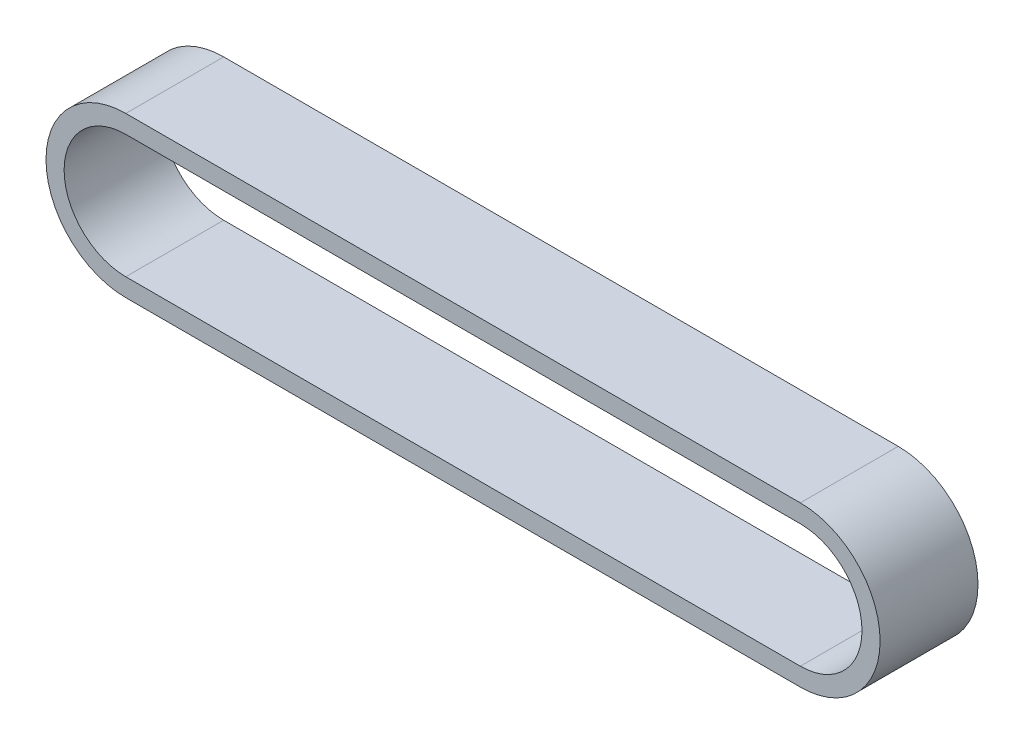
ISO-10303-21;
HEADER;
FILE_DESCRIPTION(('STEP AP214'),'2;1');
FILE_NAME('part.step','',(''),(''),'','','');
FILE_SCHEMA(('AUTOMOTIVE_DESIGN { 1 0 10303 214 1 1 1 1 }'));
ENDSEC;
DATA;
#1=APPLICATION_CONTEXT('core data for automotive mechanical design processes');
#2=APPLICATION_PROTOCOL_DEFINITION('international standard','automotive_design',2000,#1);
#3=PRODUCT_CONTEXT('',#1,'mechanical');
#4=PRODUCT('Part','Part','',(#3));
#5=PRODUCT_RELATED_PRODUCT_CATEGORY('part','',(#4));
#6=PRODUCT_DEFINITION_FORMATION('','',#4);
#7=PRODUCT_DEFINITION_CONTEXT('part definition',#1,'design');
#8=PRODUCT_DEFINITION('design','',#6,#7);
#9=PRODUCT_DEFINITION_SHAPE('','',#8);
#10=(LENGTH_UNIT() NAMED_UNIT(*) SI_UNIT(.MILLI.,.METRE.));
#11=(NAMED_UNIT(*) PLANE_ANGLE_UNIT() SI_UNIT($,.RADIAN.));
#12=(NAMED_UNIT(*) SI_UNIT($,.STERADIAN.) SOLID_ANGLE_UNIT());
#13=UNCERTAINTY_MEASURE_WITH_UNIT(LENGTH_MEASURE(1.E-05),#10,'distance_accuracy_value','');
#14=(GEOMETRIC_REPRESENTATION_CONTEXT(3) GLOBAL_UNCERTAINTY_ASSIGNED_CONTEXT((#13)) GLOBAL_UNIT_ASSIGNED_CONTEXT((#10,
#11,#12)) REPRESENTATION_CONTEXT('',''));
#15=CARTESIAN_POINT('',(0.,0.,0.));
#16=DIRECTION('',(0.,0.,1.));
#17=DIRECTION('',(1.,0.,0.));
#18=AXIS2_PLACEMENT_3D('',#15,#16,#17);
#19=CARTESIAN_POINT('',(87.5,0.,25.4));
#20=DIRECTION('',(0.,0.,1.));
#21=DIRECTION('',(1.,0.,0.));
#22=AXIS2_PLACEMENT_3D('',#19,#20,#21);
#23=PLANE('',#22);
#24=CARTESIAN_POINT('',(87.5,0.,25.4));
#25=DIRECTION('',(0.,0.,1.));
#26=DIRECTION('',(1.,0.,0.));
#27=AXIS2_PLACEMENT_3D('',#24,#25,#26);
#28=CIRCLE('',#27,20.7);
#29=CARTESIAN_POINT('',(87.5,-20.7,25.4));
#30=VERTEX_POINT('',#29);
#31=CARTESIAN_POINT('',(87.5,20.7,25.4));
#32=VERTEX_POINT('',#31);
#33=EDGE_CURVE('E153',#30,#32,#28,.T.);
#34=ORIENTED_EDGE('',*,*,#33,.T.);
#35=DIRECTION('',(-1.,0.,0.));
#36=VECTOR('',#35,1.);
#37=CARTESIAN_POINT('',(87.5,20.7,25.4));
#38=LINE('',#37,#36);
#39=CARTESIAN_POINT('',(-87.5,20.7,25.4));
#40=VERTEX_POINT('',#39);
#41=EDGE_CURVE('E157',#32,#40,#38,.T.);
#42=ORIENTED_EDGE('',*,*,#41,.T.);
#43=CARTESIAN_POINT('',(-87.5,0.,25.4));
#44=DIRECTION('',(0.,0.,1.));
#45=DIRECTION('',(1.,0.,0.));
#46=AXIS2_PLACEMENT_3D('',#43,#44,#45);
#47=CIRCLE('',#46,20.7);
#48=CARTESIAN_POINT('',(-87.5,-20.7,25.4));
#49=VERTEX_POINT('',#48);
#50=EDGE_CURVE('E161',#40,#49,#47,.T.);
#51=ORIENTED_EDGE('',*,*,#50,.T.);
#52=DIRECTION('',(1.,0.,0.));
#53=VECTOR('',#52,1.);
#54=CARTESIAN_POINT('',(87.5,-20.7,25.4));
#55=LINE('',#54,#53);
#56=EDGE_CURVE('E164',#49,#30,#55,.T.);
#57=ORIENTED_EDGE('',*,*,#56,.T.);
#58=EDGE_LOOP('',(#34,#42,#51,#57));
#59=FACE_BOUND('',#58,.T.);
#60=DIRECTION('',(-1.,0.,0.));
#61=VECTOR('',#60,1.);
#62=CARTESIAN_POINT('',(87.5,16.,25.4));
#63=LINE('',#62,#61);
#64=CARTESIAN_POINT('',(87.5,16.,25.4));
#65=VERTEX_POINT('',#64);
#66=CARTESIAN_POINT('',(-87.5,16.,25.4));
#67=VERTEX_POINT('',#66);
#68=EDGE_CURVE('E114',#65,#67,#63,.T.);
#69=ORIENTED_EDGE('',*,*,#68,.F.);
#70=CARTESIAN_POINT('',(87.5,0.,25.4));
#71=DIRECTION('',(0.,0.,1.));
#72=DIRECTION('',(1.,0.,0.));
#73=AXIS2_PLACEMENT_3D('',#70,#71,#72);
#74=CIRCLE('',#73,16.);
#75=CARTESIAN_POINT('',(87.5,-16.,25.4));
#76=VERTEX_POINT('',#75);
#77=EDGE_CURVE('E105',#76,#65,#74,.T.);
#78=ORIENTED_EDGE('',*,*,#77,.F.);
#79=DIRECTION('',(1.,0.,0.));
#80=VECTOR('',#79,1.);
#81=CARTESIAN_POINT('',(87.5,-16.,25.4));
#82=LINE('',#81,#80);
#83=CARTESIAN_POINT('',(-87.5,-16.,25.4));
#84=VERTEX_POINT('',#83);
#85=EDGE_CURVE('E131',#84,#76,#82,.T.);
#86=ORIENTED_EDGE('',*,*,#85,.F.);
#87=CARTESIAN_POINT('',(-87.5,0.,25.4));
#88=DIRECTION('',(0.,0.,1.));
#89=DIRECTION('',(1.,0.,0.));
#90=AXIS2_PLACEMENT_3D('',#87,#88,#89);
#91=CIRCLE('',#90,16.);
#92=EDGE_CURVE('E127',#67,#84,#91,.T.);
#93=ORIENTED_EDGE('',*,*,#92,.F.);
#94=EDGE_LOOP('',(#69,#78,#86,#93));
#95=FACE_BOUND('',#94,.T.);
#96=ADVANCED_FACE('F39',(#59,#95),#23,.T.);
#97=CARTESIAN_POINT('',(87.5,0.,0.));
#98=DIRECTION('',(0.,0.,1.));
#99=DIRECTION('',(1.,0.,0.));
#100=AXIS2_PLACEMENT_3D('',#97,#98,#99);
#101=PLANE('',#100);
#102=CARTESIAN_POINT('',(87.5,0.,0.));
#103=DIRECTION('',(0.,0.,1.));
#104=DIRECTION('',(1.,0.,0.));
#105=AXIS2_PLACEMENT_3D('',#102,#103,#104);
#106=CIRCLE('',#105,20.7);
#107=CARTESIAN_POINT('',(87.5,-20.7,0.));
#108=VERTEX_POINT('',#107);
#109=CARTESIAN_POINT('',(87.5,20.7,0.));
#110=VERTEX_POINT('',#109);
#111=EDGE_CURVE('E123',#108,#110,#106,.T.);
#112=ORIENTED_EDGE('',*,*,#111,.F.);
#113=DIRECTION('',(1.,0.,0.));
#114=VECTOR('',#113,1.);
#115=CARTESIAN_POINT('',(87.5,-20.7,0.));
#116=LINE('',#115,#114);
#117=CARTESIAN_POINT('',(-87.5,-20.7,0.));
#118=VERTEX_POINT('',#117);
#119=EDGE_CURVE('E158',#118,#108,#116,.T.);
#120=ORIENTED_EDGE('',*,*,#119,.F.);
#121=CARTESIAN_POINT('',(-87.5,0.,0.));
#122=DIRECTION('',(0.,0.,1.));
#123=DIRECTION('',(1.,0.,0.));
#124=AXIS2_PLACEMENT_3D('',#121,#122,#123);
#125=CIRCLE('',#124,20.7);
#126=CARTESIAN_POINT('',(-87.5,20.7,0.));
#127=VERTEX_POINT('',#126);
#128=EDGE_CURVE('E174',#127,#118,#125,.T.);
#129=ORIENTED_EDGE('',*,*,#128,.F.);
#130=DIRECTION('',(-1.,0.,0.));
#131=VECTOR('',#130,1.);
#132=CARTESIAN_POINT('',(87.5,20.7,0.));
#133=LINE('',#132,#131);
#134=EDGE_CURVE('E171',#110,#127,#133,.T.);
#135=ORIENTED_EDGE('',*,*,#134,.F.);
#136=EDGE_LOOP('',(#112,#120,#129,#135));
#137=FACE_BOUND('',#136,.T.);
#138=CARTESIAN_POINT('',(87.5,0.,0.));
#139=DIRECTION('',(0.,0.,1.));
#140=DIRECTION('',(1.,0.,0.));
#141=AXIS2_PLACEMENT_3D('',#138,#139,#140);
#142=CIRCLE('',#141,16.);
#143=CARTESIAN_POINT('',(87.5,-16.,0.));
#144=VERTEX_POINT('',#143);
#145=CARTESIAN_POINT('',(87.5,16.,0.));
#146=VERTEX_POINT('',#145);
#147=EDGE_CURVE('E63',#144,#146,#142,.T.);
#148=ORIENTED_EDGE('',*,*,#147,.T.);
#149=DIRECTION('',(-1.,0.,0.));
#150=VECTOR('',#149,1.);
#151=CARTESIAN_POINT('',(87.5,16.,0.));
#152=LINE('',#151,#150);
#153=CARTESIAN_POINT('',(-87.5,16.,0.));
#154=VERTEX_POINT('',#153);
#155=EDGE_CURVE('E121',#146,#154,#152,.T.);
#156=ORIENTED_EDGE('',*,*,#155,.T.);
#157=CARTESIAN_POINT('',(-87.5,0.,0.));
#158=DIRECTION('',(0.,0.,1.));
#159=DIRECTION('',(1.,0.,0.));
#160=AXIS2_PLACEMENT_3D('',#157,#158,#159);
#161=CIRCLE('',#160,16.);
#162=CARTESIAN_POINT('',(-87.5,-16.,0.));
#163=VERTEX_POINT('',#162);
#164=EDGE_CURVE('E140',#154,#163,#161,.T.);
#165=ORIENTED_EDGE('',*,*,#164,.T.);
#166=DIRECTION('',(1.,0.,0.));
#167=VECTOR('',#166,1.);
#168=CARTESIAN_POINT('',(87.5,-16.,0.));
#169=LINE('',#168,#167);
#170=EDGE_CURVE('E115',#163,#144,#169,.T.);
#171=ORIENTED_EDGE('',*,*,#170,.T.);
#172=EDGE_LOOP('',(#148,#156,#165,#171));
#173=FACE_BOUND('',#172,.T.);
#174=ADVANCED_FACE('F197',(#137,#173),#101,.F.);
#175=CARTESIAN_POINT('',(87.5,0.,25.4));
#176=DIRECTION('',(0.,0.,-1.));
#177=DIRECTION('',(-1.,0.,0.));
#178=AXIS2_PLACEMENT_3D('',#175,#176,#177);
#179=CYLINDRICAL_SURFACE('',#178,20.7);
#180=ORIENTED_EDGE('',*,*,#111,.T.);
#181=DIRECTION('',(0.,0.,-1.));
#182=VECTOR('',#181,1.);
#183=CARTESIAN_POINT('',(87.5,20.7,25.4));
#184=LINE('',#183,#182);
#185=EDGE_CURVE('E11',#32,#110,#184,.T.);
#186=ORIENTED_EDGE('',*,*,#185,.F.);
#187=ORIENTED_EDGE('',*,*,#33,.F.);
#188=DIRECTION('',(0.,0.,-1.));
#189=VECTOR('',#188,1.);
#190=CARTESIAN_POINT('',(87.5,-20.7,25.4));
#191=LINE('',#190,#189);
#192=EDGE_CURVE('E167',#30,#108,#191,.T.);
#193=ORIENTED_EDGE('',*,*,#192,.T.);
#194=EDGE_LOOP('',(#180,#186,#187,#193));
#195=FACE_BOUND('',#194,.T.);
#196=ADVANCED_FACE('F41',(#195),#179,.T.);
#197=CARTESIAN_POINT('',(87.5,20.7,25.4));
#198=DIRECTION('',(0.,-1.,0.));
#199=DIRECTION('',(1.,0.,0.));
#200=AXIS2_PLACEMENT_3D('',#197,#198,#199);
#201=PLANE('',#200);
#202=ORIENTED_EDGE('',*,*,#134,.T.);
#203=DIRECTION('',(0.,0.,-1.));
#204=VECTOR('',#203,1.);
#205=CARTESIAN_POINT('',(-87.5,20.7,25.4));
#206=LINE('',#205,#204);
#207=EDGE_CURVE('E48',#40,#127,#206,.T.);
#208=ORIENTED_EDGE('',*,*,#207,.F.);
#209=ORIENTED_EDGE('',*,*,#41,.F.);
#210=ORIENTED_EDGE('',*,*,#185,.T.);
#211=EDGE_LOOP('',(#202,#208,#209,#210));
#212=FACE_BOUND('',#211,.T.);
#213=ADVANCED_FACE('F207',(#212),#201,.F.);
#214=CARTESIAN_POINT('',(-87.5,0.,25.4));
#215=DIRECTION('',(0.,0.,-1.));
#216=DIRECTION('',(-1.,0.,0.));
#217=AXIS2_PLACEMENT_3D('',#214,#215,#216);
#218=CYLINDRICAL_SURFACE('',#217,20.7);
#219=ORIENTED_EDGE('',*,*,#128,.T.);
#220=DIRECTION('',(0.,0.,-1.));
#221=VECTOR('',#220,1.);
#222=CARTESIAN_POINT('',(-87.5,-20.7,25.4));
#223=LINE('',#222,#221);
#224=EDGE_CURVE('E182',#49,#118,#223,.T.);
#225=ORIENTED_EDGE('',*,*,#224,.F.);
#226=ORIENTED_EDGE('',*,*,#50,.F.);
#227=ORIENTED_EDGE('',*,*,#207,.T.);
#228=EDGE_LOOP('',(#219,#225,#226,#227));
#229=FACE_BOUND('',#228,.T.);
#230=ADVANCED_FACE('F191',(#229),#218,.T.);
#231=CARTESIAN_POINT('',(87.5,-20.7,25.4));
#232=DIRECTION('',(0.,1.,0.));
#233=DIRECTION('',(-1.,0.,0.));
#234=AXIS2_PLACEMENT_3D('',#231,#232,#233);
#235=PLANE('',#234);
#236=ORIENTED_EDGE('',*,*,#119,.T.);
#237=ORIENTED_EDGE('',*,*,#192,.F.);
#238=ORIENTED_EDGE('',*,*,#56,.F.);
#239=ORIENTED_EDGE('',*,*,#224,.T.);
#240=EDGE_LOOP('',(#236,#237,#238,#239));
#241=FACE_BOUND('',#240,.T.);
#242=ADVANCED_FACE('F201',(#241),#235,.F.);
#243=CARTESIAN_POINT('',(87.5,0.,25.4));
#244=DIRECTION('',(0.,0.,-1.));
#245=DIRECTION('',(-1.,0.,0.));
#246=AXIS2_PLACEMENT_3D('',#243,#244,#245);
#247=CYLINDRICAL_SURFACE('',#246,16.);
#248=ORIENTED_EDGE('',*,*,#147,.F.);
#249=DIRECTION('',(0.,0.,-1.));
#250=VECTOR('',#249,1.);
#251=CARTESIAN_POINT('',(87.5,-16.,25.4));
#252=LINE('',#251,#250);
#253=EDGE_CURVE('E109',#76,#144,#252,.T.);
#254=ORIENTED_EDGE('',*,*,#253,.F.);
#255=ORIENTED_EDGE('',*,*,#77,.T.);
#256=DIRECTION('',(0.,0.,-1.));
#257=VECTOR('',#256,1.);
#258=CARTESIAN_POINT('',(87.5,16.,25.4));
#259=LINE('',#258,#257);
#260=EDGE_CURVE('E108',#65,#146,#259,.T.);
#261=ORIENTED_EDGE('',*,*,#260,.T.);
#262=EDGE_LOOP('',(#248,#254,#255,#261));
#263=FACE_BOUND('',#262,.T.);
#264=ADVANCED_FACE('F107',(#263),#247,.F.);
#265=CARTESIAN_POINT('',(87.5,16.,25.4));
#266=DIRECTION('',(0.,-1.,0.));
#267=DIRECTION('',(1.,0.,0.));
#268=AXIS2_PLACEMENT_3D('',#265,#266,#267);
#269=PLANE('',#268);
#270=ORIENTED_EDGE('',*,*,#155,.F.);
#271=ORIENTED_EDGE('',*,*,#260,.F.);
#272=ORIENTED_EDGE('',*,*,#68,.T.);
#273=DIRECTION('',(0.,0.,-1.));
#274=VECTOR('',#273,1.);
#275=CARTESIAN_POINT('',(-87.5,16.,25.4));
#276=LINE('',#275,#274);
#277=EDGE_CURVE('E124',#67,#154,#276,.T.);
#278=ORIENTED_EDGE('',*,*,#277,.T.);
#279=EDGE_LOOP('',(#270,#271,#272,#278));
#280=FACE_BOUND('',#279,.T.);
#281=ADVANCED_FACE('F118',(#280),#269,.T.);
#282=CARTESIAN_POINT('',(-87.5,0.,25.4));
#283=DIRECTION('',(0.,0.,-1.));
#284=DIRECTION('',(-1.,0.,0.));
#285=AXIS2_PLACEMENT_3D('',#282,#283,#284);
#286=CYLINDRICAL_SURFACE('',#285,16.);
#287=ORIENTED_EDGE('',*,*,#164,.F.);
#288=ORIENTED_EDGE('',*,*,#277,.F.);
#289=ORIENTED_EDGE('',*,*,#92,.T.);
#290=DIRECTION('',(0.,0.,-1.));
#291=VECTOR('',#290,1.);
#292=CARTESIAN_POINT('',(-87.5,-16.,25.4));
#293=LINE('',#292,#291);
#294=EDGE_CURVE('E55',#84,#163,#293,.T.);
#295=ORIENTED_EDGE('',*,*,#294,.T.);
#296=EDGE_LOOP('',(#287,#288,#289,#295));
#297=FACE_BOUND('',#296,.T.);
#298=ADVANCED_FACE('F230',(#297),#286,.F.);
#299=CARTESIAN_POINT('',(87.5,-16.,25.4));
#300=DIRECTION('',(0.,1.,0.));
#301=DIRECTION('',(-1.,0.,0.));
#302=AXIS2_PLACEMENT_3D('',#299,#300,#301);
#303=PLANE('',#302);
#304=ORIENTED_EDGE('',*,*,#170,.F.);
#305=ORIENTED_EDGE('',*,*,#294,.F.);
#306=ORIENTED_EDGE('',*,*,#85,.T.);
#307=ORIENTED_EDGE('',*,*,#253,.T.);
#308=EDGE_LOOP('',(#304,#305,#306,#307));
#309=FACE_BOUND('',#308,.T.);
#310=ADVANCED_FACE('F234',(#309),#303,.T.);
#311=CLOSED_SHELL('',(#96,#174,#196,#213,#230,#242,#264,#281,#298,#310));
#312=MANIFOLD_SOLID_BREP('B2',#311);
#313=ADVANCED_BREP_SHAPE_REPRESENTATION('',(#18,#312),#14);
#314=SHAPE_DEFINITION_REPRESENTATION(#9,#313);
ENDSEC;
END-ISO-10303-21;
